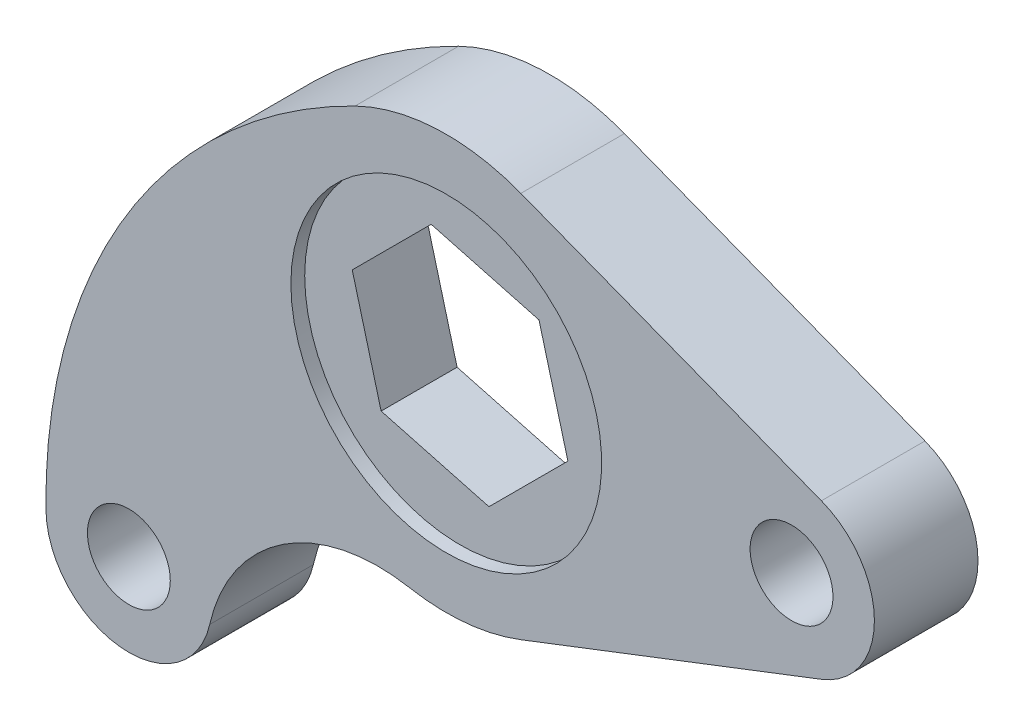
ISO-10303-21;
HEADER;
FILE_DESCRIPTION(('STEP AP214'),'2;1');
FILE_NAME('part.step','',(''),(''),'','','');
FILE_SCHEMA(('AUTOMOTIVE_DESIGN { 1 0 10303 214 1 1 1 1 }'));
ENDSEC;
DATA;
#1=APPLICATION_CONTEXT('core data for automotive mechanical design processes');
#2=APPLICATION_PROTOCOL_DEFINITION('international standard','automotive_design',2000,#1);
#3=PRODUCT_CONTEXT('',#1,'mechanical');
#4=PRODUCT('Part','Part','',(#3));
#5=PRODUCT_RELATED_PRODUCT_CATEGORY('part','',(#4));
#6=PRODUCT_DEFINITION_FORMATION('','',#4);
#7=PRODUCT_DEFINITION_CONTEXT('part definition',#1,'design');
#8=PRODUCT_DEFINITION('design','',#6,#7);
#9=PRODUCT_DEFINITION_SHAPE('','',#8);
#10=(LENGTH_UNIT() NAMED_UNIT(*) SI_UNIT(.MILLI.,.METRE.));
#11=(NAMED_UNIT(*) PLANE_ANGLE_UNIT() SI_UNIT($,.RADIAN.));
#12=(NAMED_UNIT(*) SI_UNIT($,.STERADIAN.) SOLID_ANGLE_UNIT());
#13=UNCERTAINTY_MEASURE_WITH_UNIT(LENGTH_MEASURE(1.E-05),#10,'distance_accuracy_value','');
#14=(GEOMETRIC_REPRESENTATION_CONTEXT(3) GLOBAL_UNCERTAINTY_ASSIGNED_CONTEXT((#13)) GLOBAL_UNIT_ASSIGNED_CONTEXT((#10,
#11,#12)) REPRESENTATION_CONTEXT('',''));
#15=CARTESIAN_POINT('',(0.,0.,0.));
#16=DIRECTION('',(0.,0.,1.));
#17=DIRECTION('',(1.,0.,0.));
#18=AXIS2_PLACEMENT_3D('',#15,#16,#17);
#19=CARTESIAN_POINT('',(4.18401887011759,-15.6149710031058,7.5));
#20=DIRECTION('',(-0.707106781186548,0.707106781186547,0.));
#21=DIRECTION('',(-0.707106781186547,-0.707106781186548,0.));
#22=AXIS2_PLACEMENT_3D('',#19,#20,#21);
#23=PLANE('',#22);
#24=DIRECTION('',(-0.707106781186547,-0.707106781186548,0.));
#25=VECTOR('',#24,1.);
#26=CARTESIAN_POINT('',(4.18401887011759,-15.6149710031058,5.5));
#27=LINE('',#26,#25);
#28=CARTESIAN_POINT('',(15.6149710031057,-4.18401887011757,5.5));
#29=VERTEX_POINT('',#28);
#30=CARTESIAN_POINT('',(4.18401887011759,-15.6149710031058,5.5));
#31=VERTEX_POINT('',#30);
#32=EDGE_CURVE('E47',#29,#31,#27,.T.);
#33=ORIENTED_EDGE('',*,*,#32,.F.);
#34=DIRECTION('',(0.,0.,-1.));
#35=VECTOR('',#34,1.);
#36=CARTESIAN_POINT('',(15.6149710031057,-4.18401887011757,7.5));
#37=LINE('',#36,#35);
#38=CARTESIAN_POINT('',(15.6149710031057,-4.18401887011757,-5.5));
#39=VERTEX_POINT('',#38);
#40=EDGE_CURVE('E158',#29,#39,#37,.T.);
#41=ORIENTED_EDGE('',*,*,#40,.T.);
#42=DIRECTION('',(-0.707106781186547,-0.707106781186548,0.));
#43=VECTOR('',#42,1.);
#44=CARTESIAN_POINT('',(4.18401887011759,-15.6149710031058,-5.5));
#45=LINE('',#44,#43);
#46=CARTESIAN_POINT('',(4.18401887011759,-15.6149710031058,-5.5));
#47=VERTEX_POINT('',#46);
#48=EDGE_CURVE('E151',#39,#47,#45,.T.);
#49=ORIENTED_EDGE('',*,*,#48,.T.);
#50=DIRECTION('',(0.,0.,-1.));
#51=VECTOR('',#50,1.);
#52=CARTESIAN_POINT('',(4.18401887011759,-15.6149710031058,7.5));
#53=LINE('',#52,#51);
#54=EDGE_CURVE('E147',#31,#47,#53,.T.);
#55=ORIENTED_EDGE('',*,*,#54,.F.);
#56=EDGE_LOOP('',(#33,#41,#49,#55));
#57=FACE_BOUND('',#56,.T.);
#58=ADVANCED_FACE('F33',(#57),#23,.T.);
#59=CARTESIAN_POINT('',(15.6149710031057,-4.18401887011757,7.5));
#60=DIRECTION('',(-0.965925826289068,-0.258819045102522,0.));
#61=DIRECTION('',(0.258819045102522,-0.965925826289068,0.));
#62=AXIS2_PLACEMENT_3D('',#59,#60,#61);
#63=PLANE('',#62);
#64=DIRECTION('',(0.258819045102522,-0.965925826289068,0.));
#65=VECTOR('',#64,1.);
#66=CARTESIAN_POINT('',(15.6149710031057,-4.18401887011757,5.5));
#67=LINE('',#66,#65);
#68=CARTESIAN_POINT('',(11.4309521329882,11.4309521329882,5.5));
#69=VERTEX_POINT('',#68);
#70=EDGE_CURVE('E470',#69,#29,#67,.T.);
#71=ORIENTED_EDGE('',*,*,#70,.F.);
#72=DIRECTION('',(0.,0.,-1.));
#73=VECTOR('',#72,1.);
#74=CARTESIAN_POINT('',(11.4309521329882,11.4309521329882,7.5));
#75=LINE('',#74,#73);
#76=CARTESIAN_POINT('',(11.4309521329882,11.4309521329882,-5.5));
#77=VERTEX_POINT('',#76);
#78=EDGE_CURVE('E156',#69,#77,#75,.T.);
#79=ORIENTED_EDGE('',*,*,#78,.T.);
#80=DIRECTION('',(0.258819045102522,-0.965925826289068,0.));
#81=VECTOR('',#80,1.);
#82=CARTESIAN_POINT('',(15.6149710031057,-4.18401887011757,-5.5));
#83=LINE('',#82,#81);
#84=EDGE_CURVE('E489',#77,#39,#83,.T.);
#85=ORIENTED_EDGE('',*,*,#84,.T.);
#86=ORIENTED_EDGE('',*,*,#40,.F.);
#87=EDGE_LOOP('',(#71,#79,#85,#86));
#88=FACE_BOUND('',#87,.T.);
#89=ADVANCED_FACE('F280',(#88),#63,.T.);
#90=CARTESIAN_POINT('',(11.4309521329882,11.4309521329882,7.5));
#91=DIRECTION('',(-0.25881904510252,-0.965925826289069,0.));
#92=DIRECTION('',(0.965925826289069,-0.25881904510252,0.));
#93=AXIS2_PLACEMENT_3D('',#90,#91,#92);
#94=PLANE('',#93);
#95=DIRECTION('',(0.965925826289069,-0.25881904510252,0.));
#96=VECTOR('',#95,1.);
#97=CARTESIAN_POINT('',(11.4309521329882,11.4309521329882,5.5));
#98=LINE('',#97,#96);
#99=CARTESIAN_POINT('',(-4.1840188701176,15.6149710031058,5.5));
#100=VERTEX_POINT('',#99);
#101=EDGE_CURVE('E468',#100,#69,#98,.T.);
#102=ORIENTED_EDGE('',*,*,#101,.F.);
#103=DIRECTION('',(0.,0.,-1.));
#104=VECTOR('',#103,1.);
#105=CARTESIAN_POINT('',(-4.1840188701176,15.6149710031058,7.5));
#106=LINE('',#105,#104);
#107=CARTESIAN_POINT('',(-4.1840188701176,15.6149710031058,-5.5));
#108=VERTEX_POINT('',#107);
#109=EDGE_CURVE('E149',#100,#108,#106,.T.);
#110=ORIENTED_EDGE('',*,*,#109,.T.);
#111=DIRECTION('',(0.965925826289069,-0.25881904510252,0.));
#112=VECTOR('',#111,1.);
#113=CARTESIAN_POINT('',(11.4309521329882,11.4309521329882,-5.5));
#114=LINE('',#113,#112);
#115=EDGE_CURVE('E486',#108,#77,#114,.T.);
#116=ORIENTED_EDGE('',*,*,#115,.T.);
#117=ORIENTED_EDGE('',*,*,#78,.F.);
#118=EDGE_LOOP('',(#102,#110,#116,#117));
#119=FACE_BOUND('',#118,.T.);
#120=ADVANCED_FACE('F286',(#119),#94,.T.);
#121=CARTESIAN_POINT('',(-4.1840188701176,15.6149710031058,7.5));
#122=DIRECTION('',(0.707106781186548,-0.707106781186547,0.));
#123=DIRECTION('',(0.707106781186547,0.707106781186548,0.));
#124=AXIS2_PLACEMENT_3D('',#121,#122,#123);
#125=PLANE('',#124);
#126=DIRECTION('',(0.707106781186547,0.707106781186548,0.));
#127=VECTOR('',#126,1.);
#128=CARTESIAN_POINT('',(-4.1840188701176,15.6149710031058,5.5));
#129=LINE('',#128,#127);
#130=CARTESIAN_POINT('',(-15.6149710031058,4.18401887011757,5.5));
#131=VERTEX_POINT('',#130);
#132=EDGE_CURVE('E141',#131,#100,#129,.T.);
#133=ORIENTED_EDGE('',*,*,#132,.F.);
#134=DIRECTION('',(0.,0.,-1.));
#135=VECTOR('',#134,1.);
#136=CARTESIAN_POINT('',(-15.6149710031058,4.18401887011757,7.5));
#137=LINE('',#136,#135);
#138=CARTESIAN_POINT('',(-15.6149710031058,4.18401887011757,-5.5));
#139=VERTEX_POINT('',#138);
#140=EDGE_CURVE('E140',#131,#139,#137,.T.);
#141=ORIENTED_EDGE('',*,*,#140,.T.);
#142=DIRECTION('',(0.707106781186547,0.707106781186548,0.));
#143=VECTOR('',#142,1.);
#144=CARTESIAN_POINT('',(-4.1840188701176,15.6149710031058,-5.5));
#145=LINE('',#144,#143);
#146=EDGE_CURVE('E484',#139,#108,#145,.T.);
#147=ORIENTED_EDGE('',*,*,#146,.T.);
#148=ORIENTED_EDGE('',*,*,#109,.F.);
#149=EDGE_LOOP('',(#133,#141,#147,#148));
#150=FACE_BOUND('',#149,.T.);
#151=ADVANCED_FACE('F381',(#150),#125,.T.);
#152=CARTESIAN_POINT('',(-15.6149710031058,4.18401887011757,7.5));
#153=DIRECTION('',(0.965925826289068,0.258819045102521,0.));
#154=DIRECTION('',(-0.258819045102521,0.965925826289068,0.));
#155=AXIS2_PLACEMENT_3D('',#152,#153,#154);
#156=PLANE('',#155);
#157=DIRECTION('',(-0.258819045102521,0.965925826289068,0.));
#158=VECTOR('',#157,1.);
#159=CARTESIAN_POINT('',(-15.6149710031058,4.18401887011757,5.5));
#160=LINE('',#159,#158);
#161=CARTESIAN_POINT('',(-11.4309521329882,-11.4309521329882,5.5));
#162=VERTEX_POINT('',#161);
#163=EDGE_CURVE('E134',#162,#131,#160,.T.);
#164=ORIENTED_EDGE('',*,*,#163,.F.);
#165=DIRECTION('',(0.,0.,-1.));
#166=VECTOR('',#165,1.);
#167=CARTESIAN_POINT('',(-11.4309521329882,-11.4309521329882,7.5));
#168=LINE('',#167,#166);
#169=CARTESIAN_POINT('',(-11.4309521329882,-11.4309521329882,-5.5));
#170=VERTEX_POINT('',#169);
#171=EDGE_CURVE('E55',#162,#170,#168,.T.);
#172=ORIENTED_EDGE('',*,*,#171,.T.);
#173=DIRECTION('',(-0.258819045102521,0.965925826289068,0.));
#174=VECTOR('',#173,1.);
#175=CARTESIAN_POINT('',(-15.6149710031058,4.18401887011757,-5.5));
#176=LINE('',#175,#174);
#177=EDGE_CURVE('E480',#170,#139,#176,.T.);
#178=ORIENTED_EDGE('',*,*,#177,.T.);
#179=ORIENTED_EDGE('',*,*,#140,.F.);
#180=EDGE_LOOP('',(#164,#172,#178,#179));
#181=FACE_BOUND('',#180,.T.);
#182=ADVANCED_FACE('F139',(#181),#156,.T.);
#183=CARTESIAN_POINT('',(-11.4309521329882,-11.4309521329882,7.5));
#184=DIRECTION('',(0.25881904510252,0.965925826289068,0.));
#185=DIRECTION('',(-0.965925826289068,0.25881904510252,0.));
#186=AXIS2_PLACEMENT_3D('',#183,#184,#185);
#187=PLANE('',#186);
#188=DIRECTION('',(-0.965925826289068,0.25881904510252,0.));
#189=VECTOR('',#188,1.);
#190=CARTESIAN_POINT('',(-11.4309521329882,-11.4309521329882,5.5));
#191=LINE('',#190,#189);
#192=EDGE_CURVE('E11',#31,#162,#191,.T.);
#193=ORIENTED_EDGE('',*,*,#192,.F.);
#194=ORIENTED_EDGE('',*,*,#54,.T.);
#195=DIRECTION('',(-0.965925826289068,0.25881904510252,0.));
#196=VECTOR('',#195,1.);
#197=CARTESIAN_POINT('',(-11.4309521329882,-11.4309521329882,-5.5));
#198=LINE('',#197,#196);
#199=EDGE_CURVE('E41',#47,#170,#198,.T.);
#200=ORIENTED_EDGE('',*,*,#199,.T.);
#201=ORIENTED_EDGE('',*,*,#171,.F.);
#202=EDGE_LOOP('',(#193,#194,#200,#201));
#203=FACE_BOUND('',#202,.T.);
#204=ADVANCED_FACE('F145',(#203),#187,.T.);
#205=CARTESIAN_POINT('',(22.0295371344554,-44.8854040155778,7.5));
#206=DIRECTION('',(0.,0.,-1.));
#207=DIRECTION('',(-1.,0.,0.));
#208=AXIS2_PLACEMENT_3D('',#205,#206,#207);
#209=PLANE('',#208);
#210=CARTESIAN_POINT('',(0.,0.,7.5));
#211=DIRECTION('',(0.,0.,-1.));
#212=DIRECTION('',(-1.,0.,0.));
#213=AXIS2_PLACEMENT_3D('',#210,#211,#212);
#214=CIRCLE('',#213,22.5);
#215=CARTESIAN_POINT('',(-22.5,0.,7.5));
#216=VERTEX_POINT('',#215);
#217=EDGE_CURVE('E505',#216,#216,#214,.T.);
#218=ORIENTED_EDGE('',*,*,#217,.T.);
#219=EDGE_LOOP('',(#218));
#220=FACE_BOUND('',#219,.T.);
#221=CARTESIAN_POINT('',(-45.9619407771258,-45.9619407771253,7.5));
#222=DIRECTION('',(0.,0.,1.));
#223=DIRECTION('',(1.,0.,0.));
#224=AXIS2_PLACEMENT_3D('',#221,#222,#223);
#225=CIRCLE('',#224,5.99999999999999);
#226=CARTESIAN_POINT('',(-39.9619407771258,-45.9619407771253,7.5));
#227=VERTEX_POINT('',#226);
#228=EDGE_CURVE('E161',#227,#227,#225,.T.);
#229=ORIENTED_EDGE('',*,*,#228,.F.);
#230=EDGE_LOOP('',(#229));
#231=FACE_BOUND('',#230,.T.);
#232=CARTESIAN_POINT('',(50.,0.,7.5));
#233=DIRECTION('',(0.,0.,1.));
#234=DIRECTION('',(1.,0.,0.));
#235=AXIS2_PLACEMENT_3D('',#232,#233,#234);
#236=CIRCLE('',#235,6.);
#237=CARTESIAN_POINT('',(56.,0.,7.5));
#238=VERTEX_POINT('',#237);
#239=EDGE_CURVE('E167',#238,#238,#236,.T.);
#240=ORIENTED_EDGE('',*,*,#239,.F.);
#241=EDGE_LOOP('',(#240));
#242=FACE_BOUND('',#241,.T.);
#243=CARTESIAN_POINT('',(22.0295371344554,-44.8854040155778,7.5));
#244=DIRECTION('',(0.,0.,1.));
#245=DIRECTION('',(-1.,0.,0.));
#246=AXIS2_PLACEMENT_3D('',#243,#244,#245);
#247=CIRCLE('',#246,80.);
#248=CARTESIAN_POINT('',(-13.2177222806732,26.9312424093467,7.5));
#249=VERTEX_POINT('',#248);
#250=CARTESIAN_POINT('',(-57.9604368791696,-46.1519178526925,7.5));
#251=VERTEX_POINT('',#250);
#252=EDGE_CURVE('E173',#249,#251,#247,.T.);
#253=ORIENTED_EDGE('',*,*,#252,.T.);
#254=CARTESIAN_POINT('',(-45.9619407771258,-45.9619407771253,7.5));
#255=DIRECTION('',(0.,0.,1.));
#256=DIRECTION('',(1.,0.,0.));
#257=AXIS2_PLACEMENT_3D('',#254,#255,#256);
#258=CIRCLE('',#257,12.);
#259=CARTESIAN_POINT('',(-34.2563279491275,-48.6036501330161,7.5));
#260=VERTEX_POINT('',#259);
#261=EDGE_CURVE('E176',#251,#260,#258,.T.);
#262=ORIENTED_EDGE('',*,*,#261,.T.);
#263=CARTESIAN_POINT('',(-9.86963455746429,-54.1072112911219,7.5));
#264=DIRECTION('',(0.,0.,-1.));
#265=DIRECTION('',(-1.,0.,0.));
#266=AXIS2_PLACEMENT_3D('',#263,#264,#265);
#267=CIRCLE('',#266,25.);
#268=CARTESIAN_POINT('',(-5.38343703134415,-29.5130243406119,7.5));
#269=VERTEX_POINT('',#268);
#270=EDGE_CURVE('E179',#260,#269,#267,.T.);
#271=ORIENTED_EDGE('',*,*,#270,.T.);
#272=CARTESIAN_POINT('',(0.,0.,7.5));
#273=DIRECTION('',(0.,0.,1.));
#274=DIRECTION('',(1.,0.,0.));
#275=AXIS2_PLACEMENT_3D('',#272,#273,#274);
#276=CIRCLE('',#275,30.);
#277=CARTESIAN_POINT('',(10.8,-27.9885690952574,7.5));
#278=VERTEX_POINT('',#277);
#279=EDGE_CURVE('E181',#269,#278,#276,.T.);
#280=ORIENTED_EDGE('',*,*,#279,.T.);
#281=DIRECTION('',(0.932952303175248,0.36,0.));
#282=VECTOR('',#281,1.);
#283=CARTESIAN_POINT('',(54.32,-11.195427638103,7.5));
#284=LINE('',#283,#282);
#285=CARTESIAN_POINT('',(54.32,-11.195427638103,7.5));
#286=VERTEX_POINT('',#285);
#287=EDGE_CURVE('E183',#278,#286,#284,.T.);
#288=ORIENTED_EDGE('',*,*,#287,.T.);
#289=CARTESIAN_POINT('',(50.,0.,7.5));
#290=DIRECTION('',(0.,0.,1.));
#291=DIRECTION('',(-1.,0.,0.));
#292=AXIS2_PLACEMENT_3D('',#289,#290,#291);
#293=CIRCLE('',#292,12.);
#294=CARTESIAN_POINT('',(54.32,11.195427638103,7.5));
#295=VERTEX_POINT('',#294);
#296=EDGE_CURVE('E185',#286,#295,#293,.T.);
#297=ORIENTED_EDGE('',*,*,#296,.T.);
#298=DIRECTION('',(-0.932952303175248,0.36,0.));
#299=VECTOR('',#298,1.);
#300=CARTESIAN_POINT('',(10.8,27.9885690952574,7.5));
#301=LINE('',#300,#299);
#302=CARTESIAN_POINT('',(10.8,27.9885690952574,7.5));
#303=VERTEX_POINT('',#302);
#304=EDGE_CURVE('E187',#295,#303,#301,.T.);
#305=ORIENTED_EDGE('',*,*,#304,.T.);
#306=CARTESIAN_POINT('',(0.,0.,7.5));
#307=DIRECTION('',(0.,0.,1.));
#308=DIRECTION('',(-1.,0.,0.));
#309=AXIS2_PLACEMENT_3D('',#306,#307,#308);
#310=CIRCLE('',#309,30.);
#311=EDGE_CURVE('E189',#303,#249,#310,.T.);
#312=ORIENTED_EDGE('',*,*,#311,.T.);
#313=EDGE_LOOP('',(#253,#262,#271,#280,#288,#297,#305,#312));
#314=FACE_BOUND('',#313,.T.);
#315=ADVANCED_FACE('F255',(#220,#231,#242,#314),#209,.F.);
#316=CARTESIAN_POINT('',(22.0295371344554,-44.8854040155778,-7.5));
#317=DIRECTION('',(0.,0.,-1.));
#318=DIRECTION('',(-1.,0.,0.));
#319=AXIS2_PLACEMENT_3D('',#316,#317,#318);
#320=PLANE('',#319);
#321=CARTESIAN_POINT('',(0.,0.,-7.5));
#322=DIRECTION('',(0.,0.,-1.));
#323=DIRECTION('',(-1.,0.,0.));
#324=AXIS2_PLACEMENT_3D('',#321,#322,#323);
#325=CIRCLE('',#324,22.5);
#326=CARTESIAN_POINT('',(-22.5,0.,-7.5));
#327=VERTEX_POINT('',#326);
#328=EDGE_CURVE('E476',#327,#327,#325,.T.);
#329=ORIENTED_EDGE('',*,*,#328,.F.);
#330=EDGE_LOOP('',(#329));
#331=FACE_BOUND('',#330,.T.);
#332=CARTESIAN_POINT('',(50.,0.,-7.5));
#333=DIRECTION('',(0.,0.,1.));
#334=DIRECTION('',(1.,0.,0.));
#335=AXIS2_PLACEMENT_3D('',#332,#333,#334);
#336=CIRCLE('',#335,6.);
#337=CARTESIAN_POINT('',(56.,0.,-7.5));
#338=VERTEX_POINT('',#337);
#339=EDGE_CURVE('E164',#338,#338,#336,.T.);
#340=ORIENTED_EDGE('',*,*,#339,.T.);
#341=EDGE_LOOP('',(#340));
#342=FACE_BOUND('',#341,.T.);
#343=CARTESIAN_POINT('',(22.0295371344554,-44.8854040155778,-7.5));
#344=DIRECTION('',(0.,0.,1.));
#345=DIRECTION('',(-1.,0.,0.));
#346=AXIS2_PLACEMENT_3D('',#343,#344,#345);
#347=CIRCLE('',#346,80.);
#348=CARTESIAN_POINT('',(-13.2177222806732,26.9312424093467,-7.5));
#349=VERTEX_POINT('',#348);
#350=CARTESIAN_POINT('',(-57.9604368791696,-46.1519178526925,-7.5));
#351=VERTEX_POINT('',#350);
#352=EDGE_CURVE('E170',#349,#351,#347,.T.);
#353=ORIENTED_EDGE('',*,*,#352,.F.);
#354=CARTESIAN_POINT('',(0.,0.,-7.5));
#355=DIRECTION('',(0.,0.,1.));
#356=DIRECTION('',(-1.,0.,0.));
#357=AXIS2_PLACEMENT_3D('',#354,#355,#356);
#358=CIRCLE('',#357,30.);
#359=CARTESIAN_POINT('',(10.8,27.9885690952574,-7.5));
#360=VERTEX_POINT('',#359);
#361=EDGE_CURVE('E177',#360,#349,#358,.T.);
#362=ORIENTED_EDGE('',*,*,#361,.F.);
#363=DIRECTION('',(-0.932952303175248,0.36,0.));
#364=VECTOR('',#363,1.);
#365=CARTESIAN_POINT('',(10.8,27.9885690952574,-7.5));
#366=LINE('',#365,#364);
#367=CARTESIAN_POINT('',(54.32,11.195427638103,-7.5));
#368=VERTEX_POINT('',#367);
#369=EDGE_CURVE('E204',#368,#360,#366,.T.);
#370=ORIENTED_EDGE('',*,*,#369,.F.);
#371=CARTESIAN_POINT('',(50.,0.,-7.5));
#372=DIRECTION('',(0.,0.,1.));
#373=DIRECTION('',(-1.,0.,0.));
#374=AXIS2_PLACEMENT_3D('',#371,#372,#373);
#375=CIRCLE('',#374,12.);
#376=CARTESIAN_POINT('',(54.32,-11.195427638103,-7.5));
#377=VERTEX_POINT('',#376);
#378=EDGE_CURVE('E202',#377,#368,#375,.T.);
#379=ORIENTED_EDGE('',*,*,#378,.F.);
#380=DIRECTION('',(0.932952303175248,0.36,0.));
#381=VECTOR('',#380,1.);
#382=CARTESIAN_POINT('',(54.32,-11.195427638103,-7.5));
#383=LINE('',#382,#381);
#384=CARTESIAN_POINT('',(10.8,-27.9885690952574,-7.5));
#385=VERTEX_POINT('',#384);
#386=EDGE_CURVE('E200',#385,#377,#383,.T.);
#387=ORIENTED_EDGE('',*,*,#386,.F.);
#388=CARTESIAN_POINT('',(0.,0.,-7.5));
#389=DIRECTION('',(0.,0.,1.));
#390=DIRECTION('',(1.,0.,0.));
#391=AXIS2_PLACEMENT_3D('',#388,#389,#390);
#392=CIRCLE('',#391,30.);
#393=CARTESIAN_POINT('',(-5.38343703134415,-29.5130243406119,-7.5));
#394=VERTEX_POINT('',#393);
#395=EDGE_CURVE('E198',#394,#385,#392,.T.);
#396=ORIENTED_EDGE('',*,*,#395,.F.);
#397=CARTESIAN_POINT('',(-9.86963455746429,-54.1072112911219,-7.5));
#398=DIRECTION('',(0.,0.,-1.));
#399=DIRECTION('',(-1.,0.,0.));
#400=AXIS2_PLACEMENT_3D('',#397,#398,#399);
#401=CIRCLE('',#400,25.);
#402=CARTESIAN_POINT('',(-34.2563279491275,-48.6036501330161,-7.5));
#403=VERTEX_POINT('',#402);
#404=EDGE_CURVE('E196',#403,#394,#401,.T.);
#405=ORIENTED_EDGE('',*,*,#404,.F.);
#406=CARTESIAN_POINT('',(-45.9619407771258,-45.9619407771253,-7.5));
#407=DIRECTION('',(0.,0.,1.));
#408=DIRECTION('',(1.,0.,0.));
#409=AXIS2_PLACEMENT_3D('',#406,#407,#408);
#410=CIRCLE('',#409,12.);
#411=EDGE_CURVE('E194',#351,#403,#410,.T.);
#412=ORIENTED_EDGE('',*,*,#411,.F.);
#413=EDGE_LOOP('',(#353,#362,#370,#379,#387,#396,#405,#412));
#414=FACE_BOUND('',#413,.T.);
#415=CARTESIAN_POINT('',(-45.9619407771258,-45.9619407771253,-7.5));
#416=DIRECTION('',(0.,0.,1.));
#417=DIRECTION('',(1.,0.,0.));
#418=AXIS2_PLACEMENT_3D('',#415,#416,#417);
#419=CIRCLE('',#418,5.99999999999999);
#420=CARTESIAN_POINT('',(-39.9619407771258,-45.9619407771253,-7.5));
#421=VERTEX_POINT('',#420);
#422=EDGE_CURVE('E160',#421,#421,#419,.T.);
#423=ORIENTED_EDGE('',*,*,#422,.T.);
#424=EDGE_LOOP('',(#423));
#425=FACE_BOUND('',#424,.T.);
#426=ADVANCED_FACE('F239',(#331,#342,#414,#425),#320,.T.);
#427=CARTESIAN_POINT('',(22.0295371344554,-44.8854040155778,7.5));
#428=DIRECTION('',(0.,0.,-1.));
#429=DIRECTION('',(-1.,0.,0.));
#430=AXIS2_PLACEMENT_3D('',#427,#428,#429);
#431=CYLINDRICAL_SURFACE('',#430,80.);
#432=ORIENTED_EDGE('',*,*,#352,.T.);
#433=DIRECTION('',(0.,0.,-1.));
#434=VECTOR('',#433,1.);
#435=CARTESIAN_POINT('',(-57.9604368791696,-46.1519178526925,7.5));
#436=LINE('',#435,#434);
#437=EDGE_CURVE('E227',#251,#351,#436,.T.);
#438=ORIENTED_EDGE('',*,*,#437,.F.);
#439=ORIENTED_EDGE('',*,*,#252,.F.);
#440=DIRECTION('',(0.,0.,-1.));
#441=VECTOR('',#440,1.);
#442=CARTESIAN_POINT('',(-13.2177222806732,26.9312424093467,7.5));
#443=LINE('',#442,#441);
#444=EDGE_CURVE('E191',#249,#349,#443,.T.);
#445=ORIENTED_EDGE('',*,*,#444,.T.);
#446=EDGE_LOOP('',(#432,#438,#439,#445));
#447=FACE_BOUND('',#446,.T.);
#448=ADVANCED_FACE('F35',(#447),#431,.T.);
#449=CARTESIAN_POINT('',(-45.9619407771258,-45.9619407771253,7.5));
#450=DIRECTION('',(0.,0.,-1.));
#451=DIRECTION('',(-1.,0.,0.));
#452=AXIS2_PLACEMENT_3D('',#449,#450,#451);
#453=CYLINDRICAL_SURFACE('',#452,12.);
#454=ORIENTED_EDGE('',*,*,#411,.T.);
#455=DIRECTION('',(0.,0.,-1.));
#456=VECTOR('',#455,1.);
#457=CARTESIAN_POINT('',(-34.2563279491275,-48.6036501330161,7.5));
#458=LINE('',#457,#456);
#459=EDGE_CURVE('E224',#260,#403,#458,.T.);
#460=ORIENTED_EDGE('',*,*,#459,.F.);
#461=ORIENTED_EDGE('',*,*,#261,.F.);
#462=ORIENTED_EDGE('',*,*,#437,.T.);
#463=EDGE_LOOP('',(#454,#460,#461,#462));
#464=FACE_BOUND('',#463,.T.);
#465=ADVANCED_FACE('F231',(#464),#453,.T.);
#466=CARTESIAN_POINT('',(-9.86963455746429,-54.1072112911219,7.5));
#467=DIRECTION('',(0.,0.,-1.));
#468=DIRECTION('',(-1.,0.,0.));
#469=AXIS2_PLACEMENT_3D('',#466,#467,#468);
#470=CYLINDRICAL_SURFACE('',#469,25.);
#471=ORIENTED_EDGE('',*,*,#404,.T.);
#472=DIRECTION('',(0.,0.,-1.));
#473=VECTOR('',#472,1.);
#474=CARTESIAN_POINT('',(-5.38343703134415,-29.5130243406119,7.5));
#475=LINE('',#474,#473);
#476=EDGE_CURVE('E221',#269,#394,#475,.T.);
#477=ORIENTED_EDGE('',*,*,#476,.F.);
#478=ORIENTED_EDGE('',*,*,#270,.F.);
#479=ORIENTED_EDGE('',*,*,#459,.T.);
#480=EDGE_LOOP('',(#471,#477,#478,#479));
#481=FACE_BOUND('',#480,.T.);
#482=ADVANCED_FACE('F247',(#481),#470,.F.);
#483=CARTESIAN_POINT('',(0.,0.,7.5));
#484=DIRECTION('',(0.,0.,-1.));
#485=DIRECTION('',(-1.,0.,0.));
#486=AXIS2_PLACEMENT_3D('',#483,#484,#485);
#487=CYLINDRICAL_SURFACE('',#486,30.);
#488=ORIENTED_EDGE('',*,*,#395,.T.);
#489=DIRECTION('',(0.,0.,-1.));
#490=VECTOR('',#489,1.);
#491=CARTESIAN_POINT('',(10.8,-27.9885690952574,7.5));
#492=LINE('',#491,#490);
#493=EDGE_CURVE('E218',#278,#385,#492,.T.);
#494=ORIENTED_EDGE('',*,*,#493,.F.);
#495=ORIENTED_EDGE('',*,*,#279,.F.);
#496=ORIENTED_EDGE('',*,*,#476,.T.);
#497=EDGE_LOOP('',(#488,#494,#495,#496));
#498=FACE_BOUND('',#497,.T.);
#499=ADVANCED_FACE('F251',(#498),#487,.T.);
#500=CARTESIAN_POINT('',(54.32,-11.195427638103,7.5));
#501=DIRECTION('',(-0.36,0.932952303175248,0.));
#502=DIRECTION('',(-0.932952303175248,-0.36,0.));
#503=AXIS2_PLACEMENT_3D('',#500,#501,#502);
#504=PLANE('',#503);
#505=ORIENTED_EDGE('',*,*,#386,.T.);
#506=DIRECTION('',(0.,0.,-1.));
#507=VECTOR('',#506,1.);
#508=CARTESIAN_POINT('',(54.32,-11.195427638103,7.5));
#509=LINE('',#508,#507);
#510=EDGE_CURVE('E215',#286,#377,#509,.T.);
#511=ORIENTED_EDGE('',*,*,#510,.F.);
#512=ORIENTED_EDGE('',*,*,#287,.F.);
#513=ORIENTED_EDGE('',*,*,#493,.T.);
#514=EDGE_LOOP('',(#505,#511,#512,#513));
#515=FACE_BOUND('',#514,.T.);
#516=ADVANCED_FACE('F270',(#515),#504,.F.);
#517=CARTESIAN_POINT('',(50.,0.,7.5));
#518=DIRECTION('',(0.,0.,-1.));
#519=DIRECTION('',(-1.,0.,0.));
#520=AXIS2_PLACEMENT_3D('',#517,#518,#519);
#521=CYLINDRICAL_SURFACE('',#520,12.);
#522=ORIENTED_EDGE('',*,*,#378,.T.);
#523=DIRECTION('',(0.,0.,-1.));
#524=VECTOR('',#523,1.);
#525=CARTESIAN_POINT('',(54.32,11.195427638103,7.5));
#526=LINE('',#525,#524);
#527=EDGE_CURVE('E212',#295,#368,#526,.T.);
#528=ORIENTED_EDGE('',*,*,#527,.F.);
#529=ORIENTED_EDGE('',*,*,#296,.F.);
#530=ORIENTED_EDGE('',*,*,#510,.T.);
#531=EDGE_LOOP('',(#522,#528,#529,#530));
#532=FACE_BOUND('',#531,.T.);
#533=ADVANCED_FACE('F267',(#532),#521,.T.);
#534=CARTESIAN_POINT('',(10.8,27.9885690952574,7.5));
#535=DIRECTION('',(-0.36,-0.932952303175248,0.));
#536=DIRECTION('',(0.932952303175248,-0.36,0.));
#537=AXIS2_PLACEMENT_3D('',#534,#535,#536);
#538=PLANE('',#537);
#539=ORIENTED_EDGE('',*,*,#369,.T.);
#540=DIRECTION('',(0.,0.,-1.));
#541=VECTOR('',#540,1.);
#542=CARTESIAN_POINT('',(10.8,27.9885690952574,7.5));
#543=LINE('',#542,#541);
#544=EDGE_CURVE('E209',#303,#360,#543,.T.);
#545=ORIENTED_EDGE('',*,*,#544,.F.);
#546=ORIENTED_EDGE('',*,*,#304,.F.);
#547=ORIENTED_EDGE('',*,*,#527,.T.);
#548=EDGE_LOOP('',(#539,#545,#546,#547));
#549=FACE_BOUND('',#548,.T.);
#550=ADVANCED_FACE('F263',(#549),#538,.F.);
#551=CARTESIAN_POINT('',(0.,0.,7.5));
#552=DIRECTION('',(0.,0.,-1.));
#553=DIRECTION('',(-1.,0.,0.));
#554=AXIS2_PLACEMENT_3D('',#551,#552,#553);
#555=CYLINDRICAL_SURFACE('',#554,30.);
#556=ORIENTED_EDGE('',*,*,#361,.T.);
#557=ORIENTED_EDGE('',*,*,#444,.F.);
#558=ORIENTED_EDGE('',*,*,#311,.F.);
#559=ORIENTED_EDGE('',*,*,#544,.T.);
#560=EDGE_LOOP('',(#556,#557,#558,#559));
#561=FACE_BOUND('',#560,.T.);
#562=ADVANCED_FACE('F261',(#561),#555,.T.);
#563=CARTESIAN_POINT('',(50.,0.,7.5));
#564=DIRECTION('',(0.,0.,-1.));
#565=DIRECTION('',(-1.,0.,0.));
#566=AXIS2_PLACEMENT_3D('',#563,#564,#565);
#567=CYLINDRICAL_SURFACE('',#566,6.);
#568=ORIENTED_EDGE('',*,*,#239,.T.);
#569=EDGE_LOOP('',(#568));
#570=FACE_BOUND('',#569,.T.);
#571=ORIENTED_EDGE('',*,*,#339,.F.);
#572=EDGE_LOOP('',(#571));
#573=FACE_BOUND('',#572,.T.);
#574=ADVANCED_FACE('F295',(#570,#573),#567,.F.);
#575=CARTESIAN_POINT('',(-45.9619407771258,-45.9619407771253,7.5));
#576=DIRECTION('',(0.,0.,-1.));
#577=DIRECTION('',(-1.,0.,0.));
#578=AXIS2_PLACEMENT_3D('',#575,#576,#577);
#579=CYLINDRICAL_SURFACE('',#578,5.99999999999999);
#580=ORIENTED_EDGE('',*,*,#228,.T.);
#581=EDGE_LOOP('',(#580));
#582=FACE_BOUND('',#581,.T.);
#583=ORIENTED_EDGE('',*,*,#422,.F.);
#584=EDGE_LOOP('',(#583));
#585=FACE_BOUND('',#584,.T.);
#586=ADVANCED_FACE('F291',(#582,#585),#579,.F.);
#587=CARTESIAN_POINT('',(0.,0.,-5.5));
#588=DIRECTION('',(0.,0.,-1.));
#589=DIRECTION('',(-1.,0.,0.));
#590=AXIS2_PLACEMENT_3D('',#587,#588,#589);
#591=CYLINDRICAL_SURFACE('',#590,22.5);
#592=CARTESIAN_POINT('',(0.,0.,-5.5));
#593=DIRECTION('',(0.,0.,-1.));
#594=DIRECTION('',(-1.,0.,0.));
#595=AXIS2_PLACEMENT_3D('',#592,#593,#594);
#596=CIRCLE('',#595,22.5);
#597=CARTESIAN_POINT('',(-22.5,0.,-5.5));
#598=VERTEX_POINT('',#597);
#599=EDGE_CURVE('E477',#598,#598,#596,.T.);
#600=ORIENTED_EDGE('',*,*,#599,.F.);
#601=EDGE_LOOP('',(#600));
#602=FACE_BOUND('',#601,.T.);
#603=ORIENTED_EDGE('',*,*,#328,.T.);
#604=EDGE_LOOP('',(#603));
#605=FACE_BOUND('',#604,.T.);
#606=ADVANCED_FACE('F294',(#602,#605),#591,.F.);
#607=CARTESIAN_POINT('',(0.,0.,-5.5));
#608=DIRECTION('',(0.,0.,-1.));
#609=DIRECTION('',(-1.,0.,0.));
#610=AXIS2_PLACEMENT_3D('',#607,#608,#609);
#611=PLANE('',#610);
#612=ORIENTED_EDGE('',*,*,#84,.F.);
#613=ORIENTED_EDGE('',*,*,#115,.F.);
#614=ORIENTED_EDGE('',*,*,#146,.F.);
#615=ORIENTED_EDGE('',*,*,#177,.F.);
#616=ORIENTED_EDGE('',*,*,#199,.F.);
#617=ORIENTED_EDGE('',*,*,#48,.F.);
#618=EDGE_LOOP('',(#612,#613,#614,#615,#616,#617));
#619=FACE_BOUND('',#618,.T.);
#620=ORIENTED_EDGE('',*,*,#599,.T.);
#621=EDGE_LOOP('',(#620));
#622=FACE_BOUND('',#621,.T.);
#623=ADVANCED_FACE('F332',(#619,#622),#611,.T.);
#624=CARTESIAN_POINT('',(0.,0.,5.5));
#625=DIRECTION('',(0.,0.,1.));
#626=DIRECTION('',(1.,0.,0.));
#627=AXIS2_PLACEMENT_3D('',#624,#625,#626);
#628=CYLINDRICAL_SURFACE('',#627,22.5);
#629=CARTESIAN_POINT('',(0.,0.,5.5));
#630=DIRECTION('',(0.,0.,-1.));
#631=DIRECTION('',(-1.,0.,0.));
#632=AXIS2_PLACEMENT_3D('',#629,#630,#631);
#633=CIRCLE('',#632,22.5);
#634=CARTESIAN_POINT('',(-22.5,0.,5.5));
#635=VERTEX_POINT('',#634);
#636=EDGE_CURVE('E142',#635,#635,#633,.T.);
#637=ORIENTED_EDGE('',*,*,#636,.T.);
#638=EDGE_LOOP('',(#637));
#639=FACE_BOUND('',#638,.T.);
#640=ORIENTED_EDGE('',*,*,#217,.F.);
#641=EDGE_LOOP('',(#640));
#642=FACE_BOUND('',#641,.T.);
#643=ADVANCED_FACE('F340',(#639,#642),#628,.F.);
#644=CARTESIAN_POINT('',(0.,0.,5.5));
#645=DIRECTION('',(0.,0.,-1.));
#646=DIRECTION('',(-1.,0.,0.));
#647=AXIS2_PLACEMENT_3D('',#644,#645,#646);
#648=PLANE('',#647);
#649=ORIENTED_EDGE('',*,*,#32,.T.);
#650=ORIENTED_EDGE('',*,*,#192,.T.);
#651=ORIENTED_EDGE('',*,*,#163,.T.);
#652=ORIENTED_EDGE('',*,*,#132,.T.);
#653=ORIENTED_EDGE('',*,*,#101,.T.);
#654=ORIENTED_EDGE('',*,*,#70,.T.);
#655=EDGE_LOOP('',(#649,#650,#651,#652,#653,#654));
#656=FACE_BOUND('',#655,.T.);
#657=ORIENTED_EDGE('',*,*,#636,.F.);
#658=EDGE_LOOP('',(#657));
#659=FACE_BOUND('',#658,.T.);
#660=ADVANCED_FACE('F132',(#656,#659),#648,.F.);
#661=CLOSED_SHELL('',(#58,#89,#120,#151,#182,#204,#315,#426,#448,#465,#482,#499,#516,#533,#550,
#562,#574,#586,#606,#623,#643,#660));
#662=MANIFOLD_SOLID_BREP('B2',#661);
#663=ADVANCED_BREP_SHAPE_REPRESENTATION('',(#18,#662),#14);
#664=SHAPE_DEFINITION_REPRESENTATION(#9,#663);
ENDSEC;
END-ISO-10303-21;
